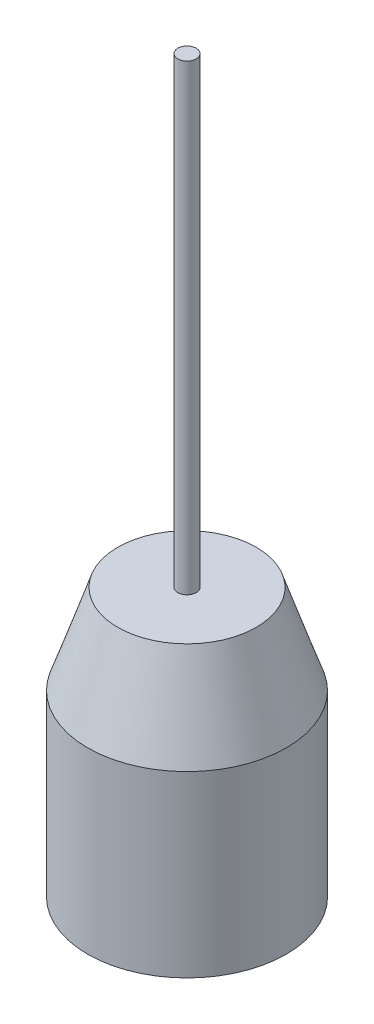
ISO-10303-21;
HEADER;
FILE_DESCRIPTION(('STEP AP214'),'2;1');
FILE_NAME('part.step','',(''),(''),'','','');
FILE_SCHEMA(('AUTOMOTIVE_DESIGN { 1 0 10303 214 1 1 1 1 }'));
ENDSEC;
DATA;
#1=APPLICATION_CONTEXT('core data for automotive mechanical design processes');
#2=APPLICATION_PROTOCOL_DEFINITION('international standard','automotive_design',2000,#1);
#3=PRODUCT_CONTEXT('',#1,'mechanical');
#4=PRODUCT('Part','Part','',(#3));
#5=PRODUCT_RELATED_PRODUCT_CATEGORY('part','',(#4));
#6=PRODUCT_DEFINITION_FORMATION('','',#4);
#7=PRODUCT_DEFINITION_CONTEXT('part definition',#1,'design');
#8=PRODUCT_DEFINITION('design','',#6,#7);
#9=PRODUCT_DEFINITION_SHAPE('','',#8);
#10=(LENGTH_UNIT() NAMED_UNIT(*) SI_UNIT(.MILLI.,.METRE.));
#11=(NAMED_UNIT(*) PLANE_ANGLE_UNIT() SI_UNIT($,.RADIAN.));
#12=(NAMED_UNIT(*) SI_UNIT($,.STERADIAN.) SOLID_ANGLE_UNIT());
#13=UNCERTAINTY_MEASURE_WITH_UNIT(LENGTH_MEASURE(1.E-05),#10,'distance_accuracy_value','');
#14=(GEOMETRIC_REPRESENTATION_CONTEXT(3) GLOBAL_UNCERTAINTY_ASSIGNED_CONTEXT((#13)) GLOBAL_UNIT_ASSIGNED_CONTEXT((#10,
#11,#12)) REPRESENTATION_CONTEXT('',''));
#15=CARTESIAN_POINT('',(0.,0.,0.));
#16=DIRECTION('',(0.,0.,1.));
#17=DIRECTION('',(1.,0.,0.));
#18=AXIS2_PLACEMENT_3D('',#15,#16,#17);
#19=CARTESIAN_POINT('',(0.,0.,0.));
#20=DIRECTION('',(0.,-1.,0.));
#21=DIRECTION('',(0.,0.,-1.));
#22=AXIS2_PLACEMENT_3D('',#19,#20,#21);
#23=CYLINDRICAL_SURFACE('',#22,2.);
#24=CARTESIAN_POINT('',(0.,158.,0.));
#25=DIRECTION('',(0.,-1.,0.));
#26=DIRECTION('',(0.,0.,-1.));
#27=AXIS2_PLACEMENT_3D('',#24,#25,#26);
#28=CIRCLE('',#27,2.);
#29=CARTESIAN_POINT('',(0.,158.,-2.));
#30=VERTEX_POINT('',#29);
#31=EDGE_CURVE('E64',#30,#30,#28,.T.);
#32=ORIENTED_EDGE('',*,*,#31,.T.);
#33=EDGE_LOOP('',(#32));
#34=FACE_BOUND('',#33,.T.);
#35=CARTESIAN_POINT('',(0.,58.,0.));
#36=DIRECTION('',(0.,-1.,0.));
#37=DIRECTION('',(0.,0.,-1.));
#38=AXIS2_PLACEMENT_3D('',#35,#36,#37);
#39=CIRCLE('',#38,2.);
#40=CARTESIAN_POINT('',(0.,58.,-2.));
#41=VERTEX_POINT('',#40);
#42=EDGE_CURVE('E11',#41,#41,#39,.T.);
#43=ORIENTED_EDGE('',*,*,#42,.F.);
#44=EDGE_LOOP('',(#43));
#45=FACE_BOUND('',#44,.T.);
#46=ADVANCED_FACE('F55',(#34,#45),#23,.T.);
#47=CARTESIAN_POINT('',(2.,158.,0.));
#48=DIRECTION('',(0.,1.,0.));
#49=DIRECTION('',(0.,0.,1.));
#50=AXIS2_PLACEMENT_3D('',#47,#48,#49);
#51=PLANE('',#50);
#52=ORIENTED_EDGE('',*,*,#31,.F.);
#53=EDGE_LOOP('',(#52));
#54=FACE_BOUND('',#53,.T.);
#55=ADVANCED_FACE('F74',(#54),#51,.T.);
#56=CARTESIAN_POINT('',(21.5,0.,0.));
#57=DIRECTION('',(0.,1.,0.));
#58=DIRECTION('',(0.,0.,1.));
#59=AXIS2_PLACEMENT_3D('',#56,#57,#58);
#60=PLANE('',#59);
#61=CARTESIAN_POINT('',(0.,0.,0.));
#62=DIRECTION('',(0.,-1.,0.));
#63=DIRECTION('',(0.,0.,-1.));
#64=AXIS2_PLACEMENT_3D('',#61,#62,#63);
#65=CIRCLE('',#64,6.985);
#66=CARTESIAN_POINT('',(0.,0.,-6.985));
#67=VERTEX_POINT('',#66);
#68=EDGE_CURVE('E89',#67,#67,#65,.T.);
#69=ORIENTED_EDGE('',*,*,#68,.F.);
#70=EDGE_LOOP('',(#69));
#71=FACE_BOUND('',#70,.T.);
#72=CARTESIAN_POINT('',(0.,0.,0.));
#73=DIRECTION('',(0.,-1.,0.));
#74=DIRECTION('',(0.,0.,-1.));
#75=AXIS2_PLACEMENT_3D('',#72,#73,#74);
#76=CIRCLE('',#75,21.5);
#77=CARTESIAN_POINT('',(0.,0.,-21.5));
#78=VERTEX_POINT('',#77);
#79=EDGE_CURVE('E59',#78,#78,#76,.T.);
#80=ORIENTED_EDGE('',*,*,#79,.T.);
#81=EDGE_LOOP('',(#80));
#82=FACE_BOUND('',#81,.T.);
#83=ADVANCED_FACE('F103',(#71,#82),#60,.F.);
#84=CARTESIAN_POINT('',(0.,0.,0.));
#85=DIRECTION('',(0.,-1.,0.));
#86=DIRECTION('',(0.,0.,-1.));
#87=AXIS2_PLACEMENT_3D('',#84,#85,#86);
#88=CYLINDRICAL_SURFACE('',#87,21.5);
#89=ORIENTED_EDGE('',*,*,#79,.F.);
#90=EDGE_LOOP('',(#89));
#91=FACE_BOUND('',#90,.T.);
#92=CARTESIAN_POINT('',(0.,38.6666666666667,0.));
#93=DIRECTION('',(0.,-1.,0.));
#94=DIRECTION('',(0.,0.,-1.));
#95=AXIS2_PLACEMENT_3D('',#92,#93,#94);
#96=CIRCLE('',#95,21.5);
#97=CARTESIAN_POINT('',(0.,38.6666666666667,-21.5));
#98=VERTEX_POINT('',#97);
#99=EDGE_CURVE('E80',#98,#98,#96,.T.);
#100=ORIENTED_EDGE('',*,*,#99,.T.);
#101=EDGE_LOOP('',(#100));
#102=FACE_BOUND('',#101,.T.);
#103=ADVANCED_FACE('F57',(#91,#102),#88,.T.);
#104=CARTESIAN_POINT('',(0.,58.,0.));
#105=DIRECTION('',(0.,-1.,0.));
#106=DIRECTION('',(0.,0.,-1.));
#107=AXIS2_PLACEMENT_3D('',#104,#105,#106);
#108=CONICAL_SURFACE('',#107,15.,0.324334527973798);
#109=ORIENTED_EDGE('',*,*,#99,.F.);
#110=EDGE_LOOP('',(#109));
#111=FACE_BOUND('',#110,.T.);
#112=CARTESIAN_POINT('',(0.,58.,0.));
#113=DIRECTION('',(0.,-1.,0.));
#114=DIRECTION('',(0.,0.,-1.));
#115=AXIS2_PLACEMENT_3D('',#112,#113,#114);
#116=CIRCLE('',#115,15.);
#117=CARTESIAN_POINT('',(0.,58.,-15.));
#118=VERTEX_POINT('',#117);
#119=EDGE_CURVE('E86',#118,#118,#116,.T.);
#120=ORIENTED_EDGE('',*,*,#119,.T.);
#121=EDGE_LOOP('',(#120));
#122=FACE_BOUND('',#121,.T.);
#123=ADVANCED_FACE('F107',(#111,#122),#108,.T.);
#124=CARTESIAN_POINT('',(0.,58.,0.));
#125=DIRECTION('',(0.,-1.,0.));
#126=DIRECTION('',(0.,0.,-1.));
#127=AXIS2_PLACEMENT_3D('',#124,#125,#126);
#128=PLANE('',#127);
#129=ORIENTED_EDGE('',*,*,#42,.T.);
#130=EDGE_LOOP('',(#129));
#131=FACE_BOUND('',#130,.T.);
#132=ORIENTED_EDGE('',*,*,#119,.F.);
#133=EDGE_LOOP('',(#132));
#134=FACE_BOUND('',#133,.T.);
#135=ADVANCED_FACE('F72',(#131,#134),#128,.F.);
#136=CARTESIAN_POINT('',(0.,30.,0.));
#137=DIRECTION('',(0.,-1.,0.));
#138=DIRECTION('',(0.,0.,-1.));
#139=AXIS2_PLACEMENT_3D('',#136,#137,#138);
#140=CONICAL_SURFACE('',#139,5.75436999999999,1.02974425867665);
#141=CARTESIAN_POINT('',(0.,33.4575743203136,0.));
#142=VERTEX_POINT('',#141);
#143=VERTEX_LOOP('',#142);
#144=FACE_BOUND('',#143,.T.);
#145=CARTESIAN_POINT('',(0.,30.,0.));
#146=DIRECTION('',(0.,-1.,0.));
#147=DIRECTION('',(0.,0.,-1.));
#148=AXIS2_PLACEMENT_3D('',#145,#146,#147);
#149=CIRCLE('',#148,5.75436999999999);
#150=CARTESIAN_POINT('',(0.,30.,-5.75436999999999));
#151=VERTEX_POINT('',#150);
#152=EDGE_CURVE('E77',#151,#151,#149,.T.);
#153=ORIENTED_EDGE('',*,*,#152,.T.);
#154=EDGE_LOOP('',(#153));
#155=FACE_BOUND('',#154,.T.);
#156=ADVANCED_FACE('F68',(#144,#155),#140,.F.);
#157=CARTESIAN_POINT('',(0.,0.,0.));
#158=DIRECTION('',(0.,-1.,0.));
#159=DIRECTION('',(0.,0.,-1.));
#160=AXIS2_PLACEMENT_3D('',#157,#158,#159);
#161=CYLINDRICAL_SURFACE('',#160,5.75436999999999);
#162=ORIENTED_EDGE('',*,*,#152,.F.);
#163=EDGE_LOOP('',(#162));
#164=FACE_BOUND('',#163,.T.);
#165=CARTESIAN_POINT('',(0.,1.23063,0.));
#166=DIRECTION('',(0.,-1.,0.));
#167=DIRECTION('',(0.,0.,-1.));
#168=AXIS2_PLACEMENT_3D('',#165,#166,#167);
#169=CIRCLE('',#168,5.75437);
#170=CARTESIAN_POINT('',(0.,1.23063,-5.75437));
#171=VERTEX_POINT('',#170);
#172=EDGE_CURVE('E81',#171,#171,#169,.T.);
#173=ORIENTED_EDGE('',*,*,#172,.T.);
#174=EDGE_LOOP('',(#173));
#175=FACE_BOUND('',#174,.T.);
#176=ADVANCED_FACE('F71',(#164,#175),#161,.F.);
#177=CARTESIAN_POINT('',(0.,0.,0.));
#178=DIRECTION('',(0.,-1.,0.));
#179=DIRECTION('',(0.,0.,-1.));
#180=AXIS2_PLACEMENT_3D('',#177,#178,#179);
#181=CONICAL_SURFACE('',#180,6.985,0.785398163397449);
#182=ORIENTED_EDGE('',*,*,#172,.F.);
#183=EDGE_LOOP('',(#182));
#184=FACE_BOUND('',#183,.T.);
#185=ORIENTED_EDGE('',*,*,#68,.T.);
#186=EDGE_LOOP('',(#185));
#187=FACE_BOUND('',#186,.T.);
#188=ADVANCED_FACE('F129',(#184,#187),#181,.F.);
#189=CLOSED_SHELL('',(#46,#55,#83,#103,#123,#135,#156,#176,#188));
#190=MANIFOLD_SOLID_BREP('B2',#189);
#191=ADVANCED_BREP_SHAPE_REPRESENTATION('',(#18,#190),#14);
#192=SHAPE_DEFINITION_REPRESENTATION(#9,#191);
ENDSEC;
END-ISO-10303-21;
